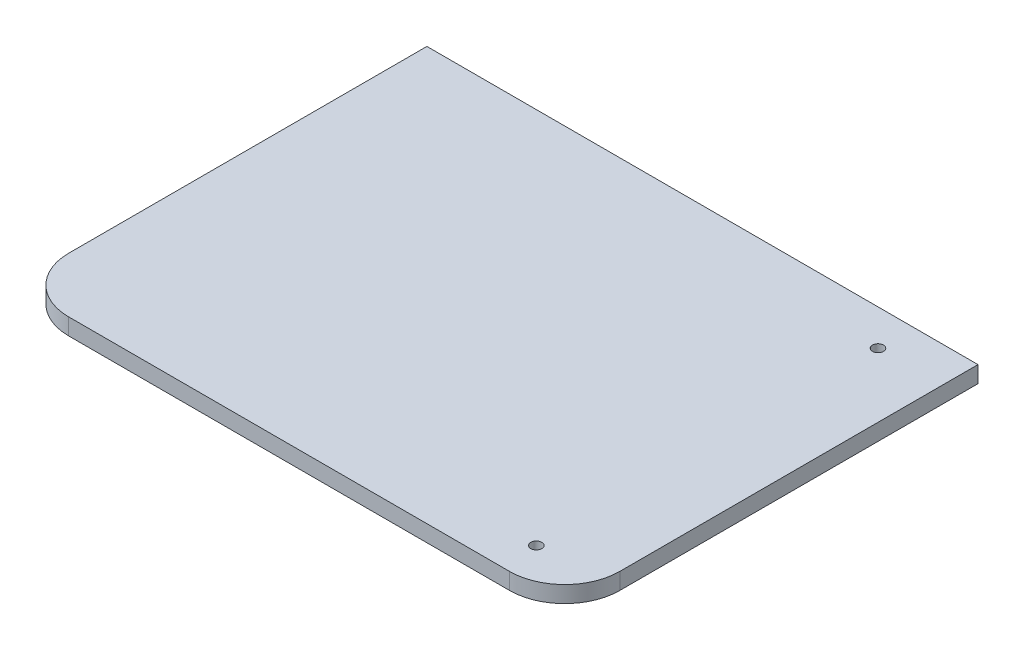
ISO-10303-21;
HEADER;
FILE_DESCRIPTION(('STEP AP214'),'2;1');
FILE_NAME('part.step','',(''),(''),'','','');
FILE_SCHEMA(('AUTOMOTIVE_DESIGN { 1 0 10303 214 1 1 1 1 }'));
ENDSEC;
DATA;
#1=APPLICATION_CONTEXT('core data for automotive mechanical design processes');
#2=APPLICATION_PROTOCOL_DEFINITION('international standard','automotive_design',2000,#1);
#3=PRODUCT_CONTEXT('',#1,'mechanical');
#4=PRODUCT('Part','Part','',(#3));
#5=PRODUCT_RELATED_PRODUCT_CATEGORY('part','',(#4));
#6=PRODUCT_DEFINITION_FORMATION('','',#4);
#7=PRODUCT_DEFINITION_CONTEXT('part definition',#1,'design');
#8=PRODUCT_DEFINITION('design','',#6,#7);
#9=PRODUCT_DEFINITION_SHAPE('','',#8);
#10=(LENGTH_UNIT() NAMED_UNIT(*) SI_UNIT(.MILLI.,.METRE.));
#11=(NAMED_UNIT(*) PLANE_ANGLE_UNIT() SI_UNIT($,.RADIAN.));
#12=(NAMED_UNIT(*) SI_UNIT($,.STERADIAN.) SOLID_ANGLE_UNIT());
#13=UNCERTAINTY_MEASURE_WITH_UNIT(LENGTH_MEASURE(1.E-05),#10,'distance_accuracy_value','');
#14=(GEOMETRIC_REPRESENTATION_CONTEXT(3) GLOBAL_UNCERTAINTY_ASSIGNED_CONTEXT((#13)) GLOBAL_UNIT_ASSIGNED_CONTEXT((#10,
#11,#12)) REPRESENTATION_CONTEXT('',''));
#15=CARTESIAN_POINT('',(0.,0.,0.));
#16=DIRECTION('',(0.,0.,1.));
#17=DIRECTION('',(1.,0.,0.));
#18=AXIS2_PLACEMENT_3D('',#15,#16,#17);
#19=CARTESIAN_POINT('',(50.,3.,-37.5));
#20=DIRECTION('',(-1.,0.,0.));
#21=DIRECTION('',(0.,0.,1.));
#22=AXIS2_PLACEMENT_3D('',#19,#20,#21);
#23=PLANE('',#22);
#24=DIRECTION('',(0.,0.,-1.));
#25=VECTOR('',#24,1.);
#26=CARTESIAN_POINT('',(50.,3.,-37.5));
#27=LINE('',#26,#25);
#28=CARTESIAN_POINT('',(50.,3.,27.5));
#29=VERTEX_POINT('',#28);
#30=CARTESIAN_POINT('',(50.,3.,-37.5));
#31=VERTEX_POINT('',#30);
#32=EDGE_CURVE('E97',#29,#31,#27,.T.);
#33=ORIENTED_EDGE('',*,*,#32,.F.);
#34=DIRECTION('',(0.,-1.,0.));
#35=VECTOR('',#34,1.);
#36=CARTESIAN_POINT('',(50.,3.,27.5));
#37=LINE('',#36,#35);
#38=CARTESIAN_POINT('',(50.,0.,27.5));
#39=VERTEX_POINT('',#38);
#40=EDGE_CURVE('E123',#29,#39,#37,.T.);
#41=ORIENTED_EDGE('',*,*,#40,.T.);
#42=DIRECTION('',(0.,0.,-1.));
#43=VECTOR('',#42,1.);
#44=CARTESIAN_POINT('',(50.,0.,-37.5));
#45=LINE('',#44,#43);
#46=CARTESIAN_POINT('',(50.,0.,-37.5));
#47=VERTEX_POINT('',#46);
#48=EDGE_CURVE('E120',#39,#47,#45,.T.);
#49=ORIENTED_EDGE('',*,*,#48,.T.);
#50=DIRECTION('',(0.,-1.,0.));
#51=VECTOR('',#50,1.);
#52=CARTESIAN_POINT('',(50.,3.,-37.5));
#53=LINE('',#52,#51);
#54=EDGE_CURVE('E113',#31,#47,#53,.T.);
#55=ORIENTED_EDGE('',*,*,#54,.F.);
#56=EDGE_LOOP('',(#33,#41,#49,#55));
#57=FACE_BOUND('',#56,.T.);
#58=ADVANCED_FACE('F42',(#57),#23,.F.);
#59=CARTESIAN_POINT('',(-50.,3.,-37.5));
#60=DIRECTION('',(0.,0.,1.));
#61=DIRECTION('',(1.,0.,0.));
#62=AXIS2_PLACEMENT_3D('',#59,#60,#61);
#63=PLANE('',#62);
#64=DIRECTION('',(-1.,0.,0.));
#65=VECTOR('',#64,1.);
#66=CARTESIAN_POINT('',(-50.,0.,-37.5));
#67=LINE('',#66,#65);
#68=CARTESIAN_POINT('',(-50.,0.,-37.5));
#69=VERTEX_POINT('',#68);
#70=EDGE_CURVE('E160',#47,#69,#67,.T.);
#71=ORIENTED_EDGE('',*,*,#70,.T.);
#72=DIRECTION('',(0.,-1.,0.));
#73=VECTOR('',#72,1.);
#74=CARTESIAN_POINT('',(-50.,3.,-37.5));
#75=LINE('',#74,#73);
#76=CARTESIAN_POINT('',(-50.,3.,-37.5));
#77=VERTEX_POINT('',#76);
#78=EDGE_CURVE('E115',#77,#69,#75,.T.);
#79=ORIENTED_EDGE('',*,*,#78,.F.);
#80=DIRECTION('',(-1.,0.,0.));
#81=VECTOR('',#80,1.);
#82=CARTESIAN_POINT('',(-50.,3.,-37.5));
#83=LINE('',#82,#81);
#84=EDGE_CURVE('E100',#31,#77,#83,.T.);
#85=ORIENTED_EDGE('',*,*,#84,.F.);
#86=ORIENTED_EDGE('',*,*,#54,.T.);
#87=EDGE_LOOP('',(#71,#79,#85,#86));
#88=FACE_BOUND('',#87,.T.);
#89=ADVANCED_FACE('F112',(#88),#63,.F.);
#90=CARTESIAN_POINT('',(-50.,3.,-37.5));
#91=DIRECTION('',(1.,0.,0.));
#92=DIRECTION('',(0.,0.,-1.));
#93=AXIS2_PLACEMENT_3D('',#90,#91,#92);
#94=PLANE('',#93);
#95=DIRECTION('',(0.,0.,1.));
#96=VECTOR('',#95,1.);
#97=CARTESIAN_POINT('',(-50.,0.,-37.5));
#98=LINE('',#97,#96);
#99=CARTESIAN_POINT('',(-50.,0.,27.5));
#100=VERTEX_POINT('',#99);
#101=EDGE_CURVE('E157',#69,#100,#98,.T.);
#102=ORIENTED_EDGE('',*,*,#101,.T.);
#103=DIRECTION('',(0.,-1.,0.));
#104=VECTOR('',#103,1.);
#105=CARTESIAN_POINT('',(-50.,3.,27.5));
#106=LINE('',#105,#104);
#107=CARTESIAN_POINT('',(-50.,3.,27.5));
#108=VERTEX_POINT('',#107);
#109=EDGE_CURVE('E11',#100,#108,#106,.F.);
#110=ORIENTED_EDGE('',*,*,#109,.T.);
#111=DIRECTION('',(0.,0.,1.));
#112=VECTOR('',#111,1.);
#113=CARTESIAN_POINT('',(-50.,3.,-37.5));
#114=LINE('',#113,#112);
#115=EDGE_CURVE('E117',#77,#108,#114,.T.);
#116=ORIENTED_EDGE('',*,*,#115,.F.);
#117=ORIENTED_EDGE('',*,*,#78,.T.);
#118=EDGE_LOOP('',(#102,#110,#116,#117));
#119=FACE_BOUND('',#118,.T.);
#120=ADVANCED_FACE('F158',(#119),#94,.F.);
#121=CARTESIAN_POINT('',(-50.,3.,37.5));
#122=DIRECTION('',(0.,0.,-1.));
#123=DIRECTION('',(-1.,0.,0.));
#124=AXIS2_PLACEMENT_3D('',#121,#122,#123);
#125=PLANE('',#124);
#126=DIRECTION('',(1.,0.,0.));
#127=VECTOR('',#126,1.);
#128=CARTESIAN_POINT('',(-50.,0.,37.5));
#129=LINE('',#128,#127);
#130=CARTESIAN_POINT('',(-40.,0.,37.5));
#131=VERTEX_POINT('',#130);
#132=CARTESIAN_POINT('',(40.,0.,37.5));
#133=VERTEX_POINT('',#132);
#134=EDGE_CURVE('E108',#131,#133,#129,.T.);
#135=ORIENTED_EDGE('',*,*,#134,.T.);
#136=DIRECTION('',(0.,-1.,0.));
#137=VECTOR('',#136,1.);
#138=CARTESIAN_POINT('',(40.,3.,37.5));
#139=LINE('',#138,#137);
#140=CARTESIAN_POINT('',(40.,3.,37.5));
#141=VERTEX_POINT('',#140);
#142=EDGE_CURVE('E64',#133,#141,#139,.F.);
#143=ORIENTED_EDGE('',*,*,#142,.T.);
#144=DIRECTION('',(1.,0.,0.));
#145=VECTOR('',#144,1.);
#146=CARTESIAN_POINT('',(-50.,3.,37.5));
#147=LINE('',#146,#145);
#148=CARTESIAN_POINT('',(-40.,3.,37.5));
#149=VERTEX_POINT('',#148);
#150=EDGE_CURVE('E129',#149,#141,#147,.T.);
#151=ORIENTED_EDGE('',*,*,#150,.F.);
#152=DIRECTION('',(0.,-1.,0.));
#153=VECTOR('',#152,1.);
#154=CARTESIAN_POINT('',(-40.,3.,37.5));
#155=LINE('',#154,#153);
#156=EDGE_CURVE('E138',#149,#131,#155,.T.);
#157=ORIENTED_EDGE('',*,*,#156,.T.);
#158=EDGE_LOOP('',(#135,#143,#151,#157));
#159=FACE_BOUND('',#158,.T.);
#160=ADVANCED_FACE('F150',(#159),#125,.F.);
#161=CARTESIAN_POINT('',(0.,3.,0.));
#162=DIRECTION('',(0.,1.,0.));
#163=DIRECTION('',(0.,0.,1.));
#164=AXIS2_PLACEMENT_3D('',#161,#162,#163);
#165=PLANE('',#164);
#166=CARTESIAN_POINT('',(38.3511708884401,3.,-31.));
#167=DIRECTION('',(0.,-1.,0.));
#168=DIRECTION('',(0.,0.,-1.));
#169=AXIS2_PLACEMENT_3D('',#166,#167,#168);
#170=CIRCLE('',#169,0.999999999999998);
#171=CARTESIAN_POINT('',(38.3511708884401,3.,-32.));
#172=VERTEX_POINT('',#171);
#173=EDGE_CURVE('E179',#172,#172,#170,.T.);
#174=ORIENTED_EDGE('',*,*,#173,.T.);
#175=EDGE_LOOP('',(#174));
#176=FACE_BOUND('',#175,.T.);
#177=CARTESIAN_POINT('',(38.3511708884401,3.,31.));
#178=DIRECTION('',(0.,1.,0.));
#179=DIRECTION('',(0.,0.,1.));
#180=AXIS2_PLACEMENT_3D('',#177,#178,#179);
#181=CIRCLE('',#180,0.999999999999998);
#182=CARTESIAN_POINT('',(38.3511708884401,3.,32.));
#183=VERTEX_POINT('',#182);
#184=EDGE_CURVE('E171',#183,#183,#181,.T.);
#185=ORIENTED_EDGE('',*,*,#184,.F.);
#186=EDGE_LOOP('',(#185));
#187=FACE_BOUND('',#186,.T.);
#188=ORIENTED_EDGE('',*,*,#150,.T.);
#189=CARTESIAN_POINT('',(40.,3.,27.5));
#190=DIRECTION('',(0.,1.,0.));
#191=DIRECTION('',(0.,0.,1.));
#192=AXIS2_PLACEMENT_3D('',#189,#190,#191);
#193=CIRCLE('',#192,10.);
#194=EDGE_CURVE('E51',#141,#29,#193,.T.);
#195=ORIENTED_EDGE('',*,*,#194,.T.);
#196=ORIENTED_EDGE('',*,*,#32,.T.);
#197=ORIENTED_EDGE('',*,*,#84,.T.);
#198=ORIENTED_EDGE('',*,*,#115,.T.);
#199=CARTESIAN_POINT('',(-40.,3.,27.5));
#200=DIRECTION('',(0.,1.,0.));
#201=DIRECTION('',(0.,0.,1.));
#202=AXIS2_PLACEMENT_3D('',#199,#200,#201);
#203=CIRCLE('',#202,10.);
#204=EDGE_CURVE('E144',#108,#149,#203,.T.);
#205=ORIENTED_EDGE('',*,*,#204,.T.);
#206=EDGE_LOOP('',(#188,#195,#196,#197,#198,#205));
#207=FACE_BOUND('',#206,.T.);
#208=ADVANCED_FACE('F99',(#176,#187,#207),#165,.T.);
#209=CARTESIAN_POINT('',(0.,0.,0.));
#210=DIRECTION('',(0.,1.,0.));
#211=DIRECTION('',(0.,0.,1.));
#212=AXIS2_PLACEMENT_3D('',#209,#210,#211);
#213=PLANE('',#212);
#214=CARTESIAN_POINT('',(38.3511708884401,0.,-31.));
#215=DIRECTION('',(0.,-1.,0.));
#216=DIRECTION('',(0.,0.,-1.));
#217=AXIS2_PLACEMENT_3D('',#214,#215,#216);
#218=CIRCLE('',#217,0.999999999999998);
#219=CARTESIAN_POINT('',(38.3511708884401,0.,-32.));
#220=VERTEX_POINT('',#219);
#221=EDGE_CURVE('E175',#220,#220,#218,.T.);
#222=ORIENTED_EDGE('',*,*,#221,.F.);
#223=EDGE_LOOP('',(#222));
#224=FACE_BOUND('',#223,.T.);
#225=CARTESIAN_POINT('',(38.3511708884401,0.,31.));
#226=DIRECTION('',(0.,1.,0.));
#227=DIRECTION('',(0.,0.,1.));
#228=AXIS2_PLACEMENT_3D('',#225,#226,#227);
#229=CIRCLE('',#228,0.999999999999998);
#230=CARTESIAN_POINT('',(38.3511708884401,0.,32.));
#231=VERTEX_POINT('',#230);
#232=EDGE_CURVE('E167',#231,#231,#229,.T.);
#233=ORIENTED_EDGE('',*,*,#232,.T.);
#234=EDGE_LOOP('',(#233));
#235=FACE_BOUND('',#234,.T.);
#236=ORIENTED_EDGE('',*,*,#48,.F.);
#237=CARTESIAN_POINT('',(40.,0.,27.5));
#238=DIRECTION('',(0.,1.,0.));
#239=DIRECTION('',(0.,0.,1.));
#240=AXIS2_PLACEMENT_3D('',#237,#238,#239);
#241=CIRCLE('',#240,10.);
#242=EDGE_CURVE('E135',#39,#133,#241,.F.);
#243=ORIENTED_EDGE('',*,*,#242,.T.);
#244=ORIENTED_EDGE('',*,*,#134,.F.);
#245=CARTESIAN_POINT('',(-40.,0.,27.5));
#246=DIRECTION('',(0.,1.,0.));
#247=DIRECTION('',(0.,0.,1.));
#248=AXIS2_PLACEMENT_3D('',#245,#246,#247);
#249=CIRCLE('',#248,10.);
#250=EDGE_CURVE('E127',#131,#100,#249,.F.);
#251=ORIENTED_EDGE('',*,*,#250,.T.);
#252=ORIENTED_EDGE('',*,*,#101,.F.);
#253=ORIENTED_EDGE('',*,*,#70,.F.);
#254=EDGE_LOOP('',(#236,#243,#244,#251,#252,#253));
#255=FACE_BOUND('',#254,.T.);
#256=ADVANCED_FACE('F156',(#224,#235,#255),#213,.F.);
#257=CARTESIAN_POINT('',(40.,3.,27.5));
#258=DIRECTION('',(0.,-1.,0.));
#259=DIRECTION('',(0.,0.,-1.));
#260=AXIS2_PLACEMENT_3D('',#257,#258,#259);
#261=CYLINDRICAL_SURFACE('',#260,10.);
#262=ORIENTED_EDGE('',*,*,#194,.F.);
#263=ORIENTED_EDGE('',*,*,#142,.F.);
#264=ORIENTED_EDGE('',*,*,#242,.F.);
#265=ORIENTED_EDGE('',*,*,#40,.F.);
#266=EDGE_LOOP('',(#262,#263,#264,#265));
#267=FACE_BOUND('',#266,.T.);
#268=ADVANCED_FACE('F192',(#267),#261,.T.);
#269=CARTESIAN_POINT('',(-40.,3.,27.5));
#270=DIRECTION('',(0.,-1.,0.));
#271=DIRECTION('',(0.,0.,-1.));
#272=AXIS2_PLACEMENT_3D('',#269,#270,#271);
#273=CYLINDRICAL_SURFACE('',#272,10.);
#274=ORIENTED_EDGE('',*,*,#204,.F.);
#275=ORIENTED_EDGE('',*,*,#109,.F.);
#276=ORIENTED_EDGE('',*,*,#250,.F.);
#277=ORIENTED_EDGE('',*,*,#156,.F.);
#278=EDGE_LOOP('',(#274,#275,#276,#277));
#279=FACE_BOUND('',#278,.T.);
#280=ADVANCED_FACE('F44',(#279),#273,.T.);
#281=CARTESIAN_POINT('',(38.3511708884401,0.,31.));
#282=DIRECTION('',(0.,1.,0.));
#283=DIRECTION('',(0.,0.,1.));
#284=AXIS2_PLACEMENT_3D('',#281,#282,#283);
#285=CYLINDRICAL_SURFACE('',#284,0.999999999999998);
#286=ORIENTED_EDGE('',*,*,#232,.F.);
#287=EDGE_LOOP('',(#286));
#288=FACE_BOUND('',#287,.T.);
#289=ORIENTED_EDGE('',*,*,#184,.T.);
#290=EDGE_LOOP('',(#289));
#291=FACE_BOUND('',#290,.T.);
#292=ADVANCED_FACE('F196',(#288,#291),#285,.F.);
#293=CARTESIAN_POINT('',(38.3511708884401,0.,-31.));
#294=DIRECTION('',(0.,1.,0.));
#295=DIRECTION('',(0.,0.,1.));
#296=AXIS2_PLACEMENT_3D('',#293,#294,#295);
#297=CYLINDRICAL_SURFACE('',#296,0.999999999999998);
#298=ORIENTED_EDGE('',*,*,#221,.T.);
#299=EDGE_LOOP('',(#298));
#300=FACE_BOUND('',#299,.T.);
#301=ORIENTED_EDGE('',*,*,#173,.F.);
#302=EDGE_LOOP('',(#301));
#303=FACE_BOUND('',#302,.T.);
#304=ADVANCED_FACE('F187',(#300,#303),#297,.F.);
#305=CLOSED_SHELL('',(#58,#89,#120,#160,#208,#256,#268,#280,#292,#304));
#306=MANIFOLD_SOLID_BREP('B2',#305);
#307=ADVANCED_BREP_SHAPE_REPRESENTATION('',(#18,#306),#14);
#308=SHAPE_DEFINITION_REPRESENTATION(#9,#307);
ENDSEC;
END-ISO-10303-21;
